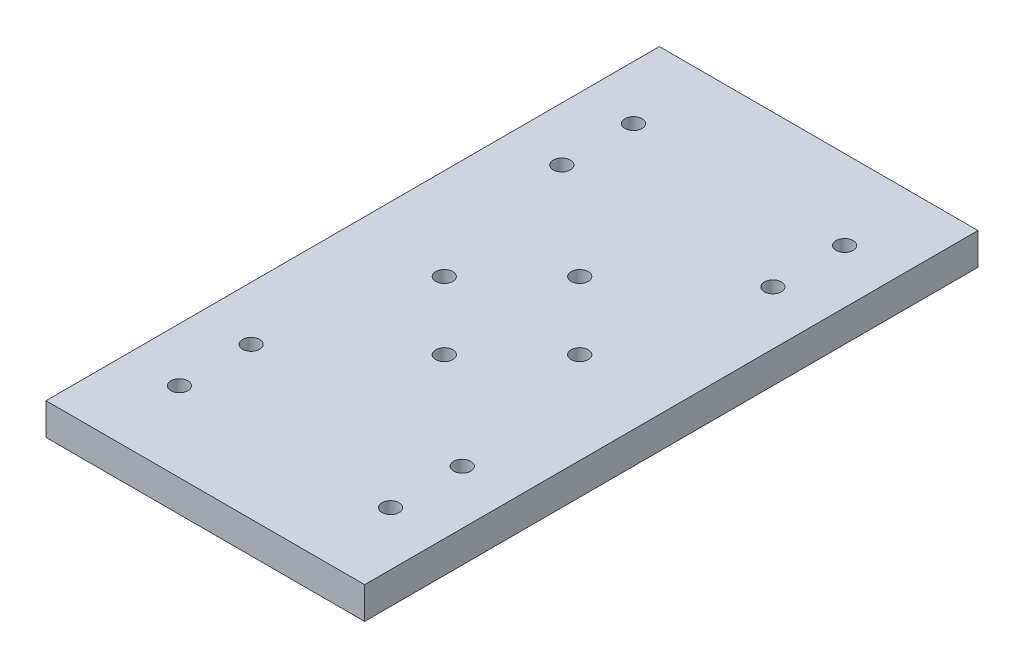
ISO-10303-21;
HEADER;
FILE_DESCRIPTION(('STEP AP214'),'2;1');
FILE_NAME('part.step','',(''),(''),'','','');
FILE_SCHEMA(('AUTOMOTIVE_DESIGN { 1 0 10303 214 1 1 1 1 }'));
ENDSEC;
DATA;
#1=APPLICATION_CONTEXT('core data for automotive mechanical design processes');
#2=APPLICATION_PROTOCOL_DEFINITION('international standard','automotive_design',2000,#1);
#3=PRODUCT_CONTEXT('',#1,'mechanical');
#4=PRODUCT('Part','Part','',(#3));
#5=PRODUCT_RELATED_PRODUCT_CATEGORY('part','',(#4));
#6=PRODUCT_DEFINITION_FORMATION('','',#4);
#7=PRODUCT_DEFINITION_CONTEXT('part definition',#1,'design');
#8=PRODUCT_DEFINITION('design','',#6,#7);
#9=PRODUCT_DEFINITION_SHAPE('','',#8);
#10=(LENGTH_UNIT() NAMED_UNIT(*) SI_UNIT(.MILLI.,.METRE.));
#11=(NAMED_UNIT(*) PLANE_ANGLE_UNIT() SI_UNIT($,.RADIAN.));
#12=(NAMED_UNIT(*) SI_UNIT($,.STERADIAN.) SOLID_ANGLE_UNIT());
#13=UNCERTAINTY_MEASURE_WITH_UNIT(LENGTH_MEASURE(1.E-05),#10,'distance_accuracy_value','');
#14=(GEOMETRIC_REPRESENTATION_CONTEXT(3) GLOBAL_UNCERTAINTY_ASSIGNED_CONTEXT((#13)) GLOBAL_UNIT_ASSIGNED_CONTEXT((#10,
#11,#12)) REPRESENTATION_CONTEXT('',''));
#15=CARTESIAN_POINT('',(0.,0.,0.));
#16=DIRECTION('',(0.,0.,1.));
#17=DIRECTION('',(1.,0.,0.));
#18=AXIS2_PLACEMENT_3D('',#15,#16,#17);
#19=CARTESIAN_POINT('',(-40.,8.,0.));
#20=DIRECTION('',(1.,0.,0.));
#21=DIRECTION('',(0.,0.,-1.));
#22=AXIS2_PLACEMENT_3D('',#19,#20,#21);
#23=PLANE('',#22);
#24=DIRECTION('',(0.,0.,1.));
#25=VECTOR('',#24,1.);
#26=CARTESIAN_POINT('',(-40.,0.,0.));
#27=LINE('',#26,#25);
#28=CARTESIAN_POINT('',(-40.,0.,-77.));
#29=VERTEX_POINT('',#28);
#30=CARTESIAN_POINT('',(-40.,0.,77.));
#31=VERTEX_POINT('',#30);
#32=EDGE_CURVE('E98',#29,#31,#27,.T.);
#33=ORIENTED_EDGE('',*,*,#32,.T.);
#34=DIRECTION('',(0.,1.,0.));
#35=VECTOR('',#34,1.);
#36=CARTESIAN_POINT('',(-40.,-2.,77.));
#37=LINE('',#36,#35);
#38=CARTESIAN_POINT('',(-40.,8.,77.));
#39=VERTEX_POINT('',#38);
#40=EDGE_CURVE('E50',#31,#39,#37,.T.);
#41=ORIENTED_EDGE('',*,*,#40,.T.);
#42=DIRECTION('',(0.,0.,1.));
#43=VECTOR('',#42,1.);
#44=CARTESIAN_POINT('',(-40.,8.,0.));
#45=LINE('',#44,#43);
#46=CARTESIAN_POINT('',(-40.,8.,-77.));
#47=VERTEX_POINT('',#46);
#48=EDGE_CURVE('E88',#47,#39,#45,.T.);
#49=ORIENTED_EDGE('',*,*,#48,.F.);
#50=DIRECTION('',(0.,1.,0.));
#51=VECTOR('',#50,1.);
#52=CARTESIAN_POINT('',(-40.,-2.,-77.));
#53=LINE('',#52,#51);
#54=EDGE_CURVE('E154',#29,#47,#53,.T.);
#55=ORIENTED_EDGE('',*,*,#54,.F.);
#56=EDGE_LOOP('',(#33,#41,#49,#55));
#57=FACE_BOUND('',#56,.T.);
#58=ADVANCED_FACE('F36',(#57),#23,.F.);
#59=CARTESIAN_POINT('',(40.,8.,0.));
#60=DIRECTION('',(-1.,0.,0.));
#61=DIRECTION('',(0.,0.,1.));
#62=AXIS2_PLACEMENT_3D('',#59,#60,#61);
#63=PLANE('',#62);
#64=DIRECTION('',(0.,0.,-1.));
#65=VECTOR('',#64,1.);
#66=CARTESIAN_POINT('',(40.,8.,0.));
#67=LINE('',#66,#65);
#68=CARTESIAN_POINT('',(40.,8.,77.));
#69=VERTEX_POINT('',#68);
#70=CARTESIAN_POINT('',(40.,8.,-77.));
#71=VERTEX_POINT('',#70);
#72=EDGE_CURVE('E85',#69,#71,#67,.T.);
#73=ORIENTED_EDGE('',*,*,#72,.F.);
#74=DIRECTION('',(0.,1.,0.));
#75=VECTOR('',#74,1.);
#76=CARTESIAN_POINT('',(40.,-2.,77.));
#77=LINE('',#76,#75);
#78=CARTESIAN_POINT('',(40.,0.,77.));
#79=VERTEX_POINT('',#78);
#80=EDGE_CURVE('E74',#79,#69,#77,.T.);
#81=ORIENTED_EDGE('',*,*,#80,.F.);
#82=DIRECTION('',(0.,0.,-1.));
#83=VECTOR('',#82,1.);
#84=CARTESIAN_POINT('',(40.,0.,0.));
#85=LINE('',#84,#83);
#86=CARTESIAN_POINT('',(40.,0.,-77.));
#87=VERTEX_POINT('',#86);
#88=EDGE_CURVE('E57',#79,#87,#85,.T.);
#89=ORIENTED_EDGE('',*,*,#88,.T.);
#90=DIRECTION('',(0.,1.,0.));
#91=VECTOR('',#90,1.);
#92=CARTESIAN_POINT('',(40.,-2.,-77.));
#93=LINE('',#92,#91);
#94=EDGE_CURVE('E92',#87,#71,#93,.T.);
#95=ORIENTED_EDGE('',*,*,#94,.T.);
#96=EDGE_LOOP('',(#73,#81,#89,#95));
#97=FACE_BOUND('',#96,.T.);
#98=ADVANCED_FACE('F91',(#97),#63,.F.);
#99=CARTESIAN_POINT('',(0.,8.,0.));
#100=DIRECTION('',(0.,1.,0.));
#101=DIRECTION('',(0.,0.,1.));
#102=AXIS2_PLACEMENT_3D('',#99,#100,#101);
#103=PLANE('',#102);
#104=CARTESIAN_POINT('',(-17.,8.,0.));
#105=DIRECTION('',(0.,1.,0.));
#106=DIRECTION('',(0.,0.,1.));
#107=AXIS2_PLACEMENT_3D('',#104,#105,#106);
#108=CIRCLE('',#107,2.14999999999999);
#109=CARTESIAN_POINT('',(-17.,8.,2.14999999999999));
#110=VERTEX_POINT('',#109);
#111=EDGE_CURVE('E180',#110,#110,#108,.T.);
#112=ORIENTED_EDGE('',*,*,#111,.F.);
#113=EDGE_LOOP('',(#112));
#114=FACE_BOUND('',#113,.T.);
#115=CARTESIAN_POINT('',(0.,8.,-17.));
#116=DIRECTION('',(0.,1.,0.));
#117=DIRECTION('',(0.,0.,1.));
#118=AXIS2_PLACEMENT_3D('',#115,#116,#117);
#119=CIRCLE('',#118,2.14999999999999);
#120=CARTESIAN_POINT('',(0.,8.,-14.85));
#121=VERTEX_POINT('',#120);
#122=EDGE_CURVE('E174',#121,#121,#119,.T.);
#123=ORIENTED_EDGE('',*,*,#122,.F.);
#124=EDGE_LOOP('',(#123));
#125=FACE_BOUND('',#124,.T.);
#126=CARTESIAN_POINT('',(17.,8.,0.));
#127=DIRECTION('',(0.,1.,0.));
#128=DIRECTION('',(0.,0.,1.));
#129=AXIS2_PLACEMENT_3D('',#126,#127,#128);
#130=CIRCLE('',#129,2.14999999999999);
#131=CARTESIAN_POINT('',(17.,8.,2.14999999999999));
#132=VERTEX_POINT('',#131);
#133=EDGE_CURVE('E168',#132,#132,#130,.T.);
#134=ORIENTED_EDGE('',*,*,#133,.F.);
#135=EDGE_LOOP('',(#134));
#136=FACE_BOUND('',#135,.T.);
#137=CARTESIAN_POINT('',(0.,8.,17.));
#138=DIRECTION('',(0.,1.,0.));
#139=DIRECTION('',(0.,0.,1.));
#140=AXIS2_PLACEMENT_3D('',#137,#138,#139);
#141=CIRCLE('',#140,2.14999999999999);
#142=CARTESIAN_POINT('',(0.,8.,19.15));
#143=VERTEX_POINT('',#142);
#144=EDGE_CURVE('E162',#143,#143,#141,.T.);
#145=ORIENTED_EDGE('',*,*,#144,.F.);
#146=EDGE_LOOP('',(#145));
#147=FACE_BOUND('',#146,.T.);
#148=DIRECTION('',(-1.,0.,0.));
#149=VECTOR('',#148,1.);
#150=CARTESIAN_POINT('',(40.,8.,77.));
#151=LINE('',#150,#149);
#152=EDGE_CURVE('E77',#69,#39,#151,.T.);
#153=ORIENTED_EDGE('',*,*,#152,.F.);
#154=ORIENTED_EDGE('',*,*,#72,.T.);
#155=DIRECTION('',(1.,0.,0.));
#156=VECTOR('',#155,1.);
#157=CARTESIAN_POINT('',(-40.,8.,-77.));
#158=LINE('',#157,#156);
#159=EDGE_CURVE('E156',#47,#71,#158,.T.);
#160=ORIENTED_EDGE('',*,*,#159,.F.);
#161=ORIENTED_EDGE('',*,*,#48,.T.);
#162=EDGE_LOOP('',(#153,#154,#160,#161));
#163=FACE_BOUND('',#162,.T.);
#164=CARTESIAN_POINT('',(-26.5,8.,-57.));
#165=DIRECTION('',(0.,1.,0.));
#166=DIRECTION('',(0.,0.,1.));
#167=AXIS2_PLACEMENT_3D('',#164,#165,#166);
#168=CIRCLE('',#167,2.15);
#169=CARTESIAN_POINT('',(-26.5,8.,-54.85));
#170=VERTEX_POINT('',#169);
#171=EDGE_CURVE('E151',#170,#170,#168,.T.);
#172=ORIENTED_EDGE('',*,*,#171,.F.);
#173=EDGE_LOOP('',(#172));
#174=FACE_BOUND('',#173,.T.);
#175=CARTESIAN_POINT('',(26.5,8.,-57.));
#176=DIRECTION('',(0.,1.,0.));
#177=DIRECTION('',(0.,0.,1.));
#178=AXIS2_PLACEMENT_3D('',#175,#176,#177);
#179=CIRCLE('',#178,2.15);
#180=CARTESIAN_POINT('',(26.5,8.,-54.85));
#181=VERTEX_POINT('',#180);
#182=EDGE_CURVE('E145',#181,#181,#179,.T.);
#183=ORIENTED_EDGE('',*,*,#182,.F.);
#184=EDGE_LOOP('',(#183));
#185=FACE_BOUND('',#184,.T.);
#186=CARTESIAN_POINT('',(-26.5,8.,-39.));
#187=DIRECTION('',(0.,1.,0.));
#188=DIRECTION('',(0.,0.,1.));
#189=AXIS2_PLACEMENT_3D('',#186,#187,#188);
#190=CIRCLE('',#189,2.15);
#191=CARTESIAN_POINT('',(-26.5,8.,-36.85));
#192=VERTEX_POINT('',#191);
#193=EDGE_CURVE('E139',#192,#192,#190,.T.);
#194=ORIENTED_EDGE('',*,*,#193,.F.);
#195=EDGE_LOOP('',(#194));
#196=FACE_BOUND('',#195,.T.);
#197=CARTESIAN_POINT('',(26.5,8.,-39.));
#198=DIRECTION('',(0.,1.,0.));
#199=DIRECTION('',(0.,0.,1.));
#200=AXIS2_PLACEMENT_3D('',#197,#198,#199);
#201=CIRCLE('',#200,2.15);
#202=CARTESIAN_POINT('',(26.5,8.,-36.85));
#203=VERTEX_POINT('',#202);
#204=EDGE_CURVE('E133',#203,#203,#201,.T.);
#205=ORIENTED_EDGE('',*,*,#204,.F.);
#206=EDGE_LOOP('',(#205));
#207=FACE_BOUND('',#206,.T.);
#208=CARTESIAN_POINT('',(26.5,8.,39.));
#209=DIRECTION('',(0.,1.,0.));
#210=DIRECTION('',(0.,0.,1.));
#211=AXIS2_PLACEMENT_3D('',#208,#209,#210);
#212=CIRCLE('',#211,2.15);
#213=CARTESIAN_POINT('',(26.5,8.,41.15));
#214=VERTEX_POINT('',#213);
#215=EDGE_CURVE('E127',#214,#214,#212,.T.);
#216=ORIENTED_EDGE('',*,*,#215,.F.);
#217=EDGE_LOOP('',(#216));
#218=FACE_BOUND('',#217,.T.);
#219=CARTESIAN_POINT('',(-26.5,8.,39.));
#220=DIRECTION('',(0.,1.,0.));
#221=DIRECTION('',(0.,0.,1.));
#222=AXIS2_PLACEMENT_3D('',#219,#220,#221);
#223=CIRCLE('',#222,2.15);
#224=CARTESIAN_POINT('',(-26.5,8.,41.15));
#225=VERTEX_POINT('',#224);
#226=EDGE_CURVE('E121',#225,#225,#223,.T.);
#227=ORIENTED_EDGE('',*,*,#226,.F.);
#228=EDGE_LOOP('',(#227));
#229=FACE_BOUND('',#228,.T.);
#230=CARTESIAN_POINT('',(26.5,8.,57.));
#231=DIRECTION('',(0.,1.,0.));
#232=DIRECTION('',(0.,0.,1.));
#233=AXIS2_PLACEMENT_3D('',#230,#231,#232);
#234=CIRCLE('',#233,2.15);
#235=CARTESIAN_POINT('',(26.5,8.,59.15));
#236=VERTEX_POINT('',#235);
#237=EDGE_CURVE('E115',#236,#236,#234,.T.);
#238=ORIENTED_EDGE('',*,*,#237,.F.);
#239=EDGE_LOOP('',(#238));
#240=FACE_BOUND('',#239,.T.);
#241=CARTESIAN_POINT('',(-26.5,8.,57.));
#242=DIRECTION('',(0.,1.,0.));
#243=DIRECTION('',(0.,0.,1.));
#244=AXIS2_PLACEMENT_3D('',#241,#242,#243);
#245=CIRCLE('',#244,2.15);
#246=CARTESIAN_POINT('',(-26.5,8.,59.15));
#247=VERTEX_POINT('',#246);
#248=EDGE_CURVE('E106',#247,#247,#245,.T.);
#249=ORIENTED_EDGE('',*,*,#248,.F.);
#250=EDGE_LOOP('',(#249));
#251=FACE_BOUND('',#250,.T.);
#252=ADVANCED_FACE('F82',(#114,#125,#136,#147,#163,#174,#185,#196,#207,#218,#229,#240,#251),
#103,.T.);
#253=CARTESIAN_POINT('',(0.,0.,0.));
#254=DIRECTION('',(0.,1.,0.));
#255=DIRECTION('',(0.,0.,1.));
#256=AXIS2_PLACEMENT_3D('',#253,#254,#255);
#257=PLANE('',#256);
#258=CARTESIAN_POINT('',(-17.,0.,0.));
#259=DIRECTION('',(0.,1.,0.));
#260=DIRECTION('',(0.,0.,1.));
#261=AXIS2_PLACEMENT_3D('',#258,#259,#260);
#262=CIRCLE('',#261,2.15);
#263=CARTESIAN_POINT('',(-17.,0.,2.15));
#264=VERTEX_POINT('',#263);
#265=EDGE_CURVE('E177',#264,#264,#262,.T.);
#266=ORIENTED_EDGE('',*,*,#265,.T.);
#267=EDGE_LOOP('',(#266));
#268=FACE_BOUND('',#267,.T.);
#269=CARTESIAN_POINT('',(0.,0.,-17.));
#270=DIRECTION('',(0.,1.,0.));
#271=DIRECTION('',(0.,0.,1.));
#272=AXIS2_PLACEMENT_3D('',#269,#270,#271);
#273=CIRCLE('',#272,2.15);
#274=CARTESIAN_POINT('',(0.,0.,-14.85));
#275=VERTEX_POINT('',#274);
#276=EDGE_CURVE('E171',#275,#275,#273,.T.);
#277=ORIENTED_EDGE('',*,*,#276,.T.);
#278=EDGE_LOOP('',(#277));
#279=FACE_BOUND('',#278,.T.);
#280=CARTESIAN_POINT('',(17.,0.,0.));
#281=DIRECTION('',(0.,1.,0.));
#282=DIRECTION('',(0.,0.,1.));
#283=AXIS2_PLACEMENT_3D('',#280,#281,#282);
#284=CIRCLE('',#283,2.15);
#285=CARTESIAN_POINT('',(17.,0.,2.15));
#286=VERTEX_POINT('',#285);
#287=EDGE_CURVE('E165',#286,#286,#284,.T.);
#288=ORIENTED_EDGE('',*,*,#287,.T.);
#289=EDGE_LOOP('',(#288));
#290=FACE_BOUND('',#289,.T.);
#291=CARTESIAN_POINT('',(0.,0.,17.));
#292=DIRECTION('',(0.,1.,0.));
#293=DIRECTION('',(0.,0.,1.));
#294=AXIS2_PLACEMENT_3D('',#291,#292,#293);
#295=CIRCLE('',#294,2.15);
#296=CARTESIAN_POINT('',(0.,0.,19.15));
#297=VERTEX_POINT('',#296);
#298=EDGE_CURVE('E89',#297,#297,#295,.T.);
#299=ORIENTED_EDGE('',*,*,#298,.T.);
#300=EDGE_LOOP('',(#299));
#301=FACE_BOUND('',#300,.T.);
#302=CARTESIAN_POINT('',(-26.5,0.,-57.));
#303=DIRECTION('',(0.,1.,0.));
#304=DIRECTION('',(0.,0.,1.));
#305=AXIS2_PLACEMENT_3D('',#302,#303,#304);
#306=CIRCLE('',#305,2.15);
#307=CARTESIAN_POINT('',(-26.5,0.,-54.85));
#308=VERTEX_POINT('',#307);
#309=EDGE_CURVE('E148',#308,#308,#306,.T.);
#310=ORIENTED_EDGE('',*,*,#309,.T.);
#311=EDGE_LOOP('',(#310));
#312=FACE_BOUND('',#311,.T.);
#313=CARTESIAN_POINT('',(26.5,0.,-57.));
#314=DIRECTION('',(0.,1.,0.));
#315=DIRECTION('',(0.,0.,1.));
#316=AXIS2_PLACEMENT_3D('',#313,#314,#315);
#317=CIRCLE('',#316,2.15);
#318=CARTESIAN_POINT('',(26.5,0.,-54.85));
#319=VERTEX_POINT('',#318);
#320=EDGE_CURVE('E142',#319,#319,#317,.T.);
#321=ORIENTED_EDGE('',*,*,#320,.T.);
#322=EDGE_LOOP('',(#321));
#323=FACE_BOUND('',#322,.T.);
#324=CARTESIAN_POINT('',(-26.5,0.,-39.));
#325=DIRECTION('',(0.,1.,0.));
#326=DIRECTION('',(0.,0.,1.));
#327=AXIS2_PLACEMENT_3D('',#324,#325,#326);
#328=CIRCLE('',#327,2.15);
#329=CARTESIAN_POINT('',(-26.5,0.,-36.85));
#330=VERTEX_POINT('',#329);
#331=EDGE_CURVE('E136',#330,#330,#328,.T.);
#332=ORIENTED_EDGE('',*,*,#331,.T.);
#333=EDGE_LOOP('',(#332));
#334=FACE_BOUND('',#333,.T.);
#335=CARTESIAN_POINT('',(26.5,0.,-39.));
#336=DIRECTION('',(0.,1.,0.));
#337=DIRECTION('',(0.,0.,1.));
#338=AXIS2_PLACEMENT_3D('',#335,#336,#337);
#339=CIRCLE('',#338,2.15);
#340=CARTESIAN_POINT('',(26.5,0.,-36.85));
#341=VERTEX_POINT('',#340);
#342=EDGE_CURVE('E130',#341,#341,#339,.T.);
#343=ORIENTED_EDGE('',*,*,#342,.T.);
#344=EDGE_LOOP('',(#343));
#345=FACE_BOUND('',#344,.T.);
#346=CARTESIAN_POINT('',(26.5,0.,39.));
#347=DIRECTION('',(0.,1.,0.));
#348=DIRECTION('',(0.,0.,1.));
#349=AXIS2_PLACEMENT_3D('',#346,#347,#348);
#350=CIRCLE('',#349,2.15);
#351=CARTESIAN_POINT('',(26.5,0.,41.15));
#352=VERTEX_POINT('',#351);
#353=EDGE_CURVE('E124',#352,#352,#350,.T.);
#354=ORIENTED_EDGE('',*,*,#353,.T.);
#355=EDGE_LOOP('',(#354));
#356=FACE_BOUND('',#355,.T.);
#357=CARTESIAN_POINT('',(-26.5,0.,39.));
#358=DIRECTION('',(0.,1.,0.));
#359=DIRECTION('',(0.,0.,1.));
#360=AXIS2_PLACEMENT_3D('',#357,#358,#359);
#361=CIRCLE('',#360,2.15);
#362=CARTESIAN_POINT('',(-26.5,0.,41.15));
#363=VERTEX_POINT('',#362);
#364=EDGE_CURVE('E118',#363,#363,#361,.T.);
#365=ORIENTED_EDGE('',*,*,#364,.T.);
#366=EDGE_LOOP('',(#365));
#367=FACE_BOUND('',#366,.T.);
#368=CARTESIAN_POINT('',(26.5,0.,57.));
#369=DIRECTION('',(0.,1.,0.));
#370=DIRECTION('',(0.,0.,1.));
#371=AXIS2_PLACEMENT_3D('',#368,#369,#370);
#372=CIRCLE('',#371,2.15);
#373=CARTESIAN_POINT('',(26.5,0.,59.15));
#374=VERTEX_POINT('',#373);
#375=EDGE_CURVE('E110',#374,#374,#372,.T.);
#376=ORIENTED_EDGE('',*,*,#375,.T.);
#377=EDGE_LOOP('',(#376));
#378=FACE_BOUND('',#377,.T.);
#379=CARTESIAN_POINT('',(-26.5,0.,57.));
#380=DIRECTION('',(0.,1.,0.));
#381=DIRECTION('',(0.,0.,1.));
#382=AXIS2_PLACEMENT_3D('',#379,#380,#381);
#383=CIRCLE('',#382,2.15);
#384=CARTESIAN_POINT('',(-26.5,0.,59.15));
#385=VERTEX_POINT('',#384);
#386=EDGE_CURVE('E101',#385,#385,#383,.T.);
#387=ORIENTED_EDGE('',*,*,#386,.T.);
#388=EDGE_LOOP('',(#387));
#389=FACE_BOUND('',#388,.T.);
#390=ORIENTED_EDGE('',*,*,#88,.F.);
#391=DIRECTION('',(-1.,0.,0.));
#392=VECTOR('',#391,1.);
#393=CARTESIAN_POINT('',(0.,0.,77.));
#394=LINE('',#393,#392);
#395=EDGE_CURVE('E11',#79,#31,#394,.T.);
#396=ORIENTED_EDGE('',*,*,#395,.T.);
#397=ORIENTED_EDGE('',*,*,#32,.F.);
#398=DIRECTION('',(1.,0.,0.));
#399=VECTOR('',#398,1.);
#400=CARTESIAN_POINT('',(0.,0.,-77.));
#401=LINE('',#400,#399);
#402=EDGE_CURVE('E43',#29,#87,#401,.T.);
#403=ORIENTED_EDGE('',*,*,#402,.T.);
#404=EDGE_LOOP('',(#390,#396,#397,#403));
#405=FACE_BOUND('',#404,.T.);
#406=ADVANCED_FACE('F188',(#268,#279,#290,#301,#312,#323,#334,#345,#356,#367,#378,#389,#405),
#257,.F.);
#407=CARTESIAN_POINT('',(-26.5,8.,57.));
#408=DIRECTION('',(0.,1.,0.));
#409=DIRECTION('',(0.,0.,1.));
#410=AXIS2_PLACEMENT_3D('',#407,#408,#409);
#411=CYLINDRICAL_SURFACE('',#410,2.15);
#412=ORIENTED_EDGE('',*,*,#386,.F.);
#413=EDGE_LOOP('',(#412));
#414=FACE_BOUND('',#413,.T.);
#415=ORIENTED_EDGE('',*,*,#248,.T.);
#416=EDGE_LOOP('',(#415));
#417=FACE_BOUND('',#416,.T.);
#418=ADVANCED_FACE('F219',(#414,#417),#411,.F.);
#419=CARTESIAN_POINT('',(26.5,8.,57.));
#420=DIRECTION('',(0.,1.,0.));
#421=DIRECTION('',(0.,0.,1.));
#422=AXIS2_PLACEMENT_3D('',#419,#420,#421);
#423=CYLINDRICAL_SURFACE('',#422,2.15);
#424=ORIENTED_EDGE('',*,*,#375,.F.);
#425=EDGE_LOOP('',(#424));
#426=FACE_BOUND('',#425,.T.);
#427=ORIENTED_EDGE('',*,*,#237,.T.);
#428=EDGE_LOOP('',(#427));
#429=FACE_BOUND('',#428,.T.);
#430=ADVANCED_FACE('F224',(#426,#429),#423,.F.);
#431=CARTESIAN_POINT('',(-26.5,8.,39.));
#432=DIRECTION('',(0.,1.,0.));
#433=DIRECTION('',(0.,0.,1.));
#434=AXIS2_PLACEMENT_3D('',#431,#432,#433);
#435=CYLINDRICAL_SURFACE('',#434,2.15);
#436=ORIENTED_EDGE('',*,*,#364,.F.);
#437=EDGE_LOOP('',(#436));
#438=FACE_BOUND('',#437,.T.);
#439=ORIENTED_EDGE('',*,*,#226,.T.);
#440=EDGE_LOOP('',(#439));
#441=FACE_BOUND('',#440,.T.);
#442=ADVANCED_FACE('F228',(#438,#441),#435,.F.);
#443=CARTESIAN_POINT('',(26.5,8.,39.));
#444=DIRECTION('',(0.,1.,0.));
#445=DIRECTION('',(0.,0.,1.));
#446=AXIS2_PLACEMENT_3D('',#443,#444,#445);
#447=CYLINDRICAL_SURFACE('',#446,2.15);
#448=ORIENTED_EDGE('',*,*,#353,.F.);
#449=EDGE_LOOP('',(#448));
#450=FACE_BOUND('',#449,.T.);
#451=ORIENTED_EDGE('',*,*,#215,.T.);
#452=EDGE_LOOP('',(#451));
#453=FACE_BOUND('',#452,.T.);
#454=ADVANCED_FACE('F232',(#450,#453),#447,.F.);
#455=CARTESIAN_POINT('',(26.5,8.,-39.));
#456=DIRECTION('',(0.,1.,0.));
#457=DIRECTION('',(0.,0.,1.));
#458=AXIS2_PLACEMENT_3D('',#455,#456,#457);
#459=CYLINDRICAL_SURFACE('',#458,2.15);
#460=ORIENTED_EDGE('',*,*,#342,.F.);
#461=EDGE_LOOP('',(#460));
#462=FACE_BOUND('',#461,.T.);
#463=ORIENTED_EDGE('',*,*,#204,.T.);
#464=EDGE_LOOP('',(#463));
#465=FACE_BOUND('',#464,.T.);
#466=ADVANCED_FACE('F236',(#462,#465),#459,.F.);
#467=CARTESIAN_POINT('',(-26.5,8.,-39.));
#468=DIRECTION('',(0.,1.,0.));
#469=DIRECTION('',(0.,0.,1.));
#470=AXIS2_PLACEMENT_3D('',#467,#468,#469);
#471=CYLINDRICAL_SURFACE('',#470,2.15);
#472=ORIENTED_EDGE('',*,*,#331,.F.);
#473=EDGE_LOOP('',(#472));
#474=FACE_BOUND('',#473,.T.);
#475=ORIENTED_EDGE('',*,*,#193,.T.);
#476=EDGE_LOOP('',(#475));
#477=FACE_BOUND('',#476,.T.);
#478=ADVANCED_FACE('F240',(#474,#477),#471,.F.);
#479=CARTESIAN_POINT('',(26.5,8.,-57.));
#480=DIRECTION('',(0.,1.,0.));
#481=DIRECTION('',(0.,0.,1.));
#482=AXIS2_PLACEMENT_3D('',#479,#480,#481);
#483=CYLINDRICAL_SURFACE('',#482,2.15);
#484=ORIENTED_EDGE('',*,*,#320,.F.);
#485=EDGE_LOOP('',(#484));
#486=FACE_BOUND('',#485,.T.);
#487=ORIENTED_EDGE('',*,*,#182,.T.);
#488=EDGE_LOOP('',(#487));
#489=FACE_BOUND('',#488,.T.);
#490=ADVANCED_FACE('F244',(#486,#489),#483,.F.);
#491=CARTESIAN_POINT('',(-26.5,8.,-57.));
#492=DIRECTION('',(0.,1.,0.));
#493=DIRECTION('',(0.,0.,1.));
#494=AXIS2_PLACEMENT_3D('',#491,#492,#493);
#495=CYLINDRICAL_SURFACE('',#494,2.15);
#496=ORIENTED_EDGE('',*,*,#309,.F.);
#497=EDGE_LOOP('',(#496));
#498=FACE_BOUND('',#497,.T.);
#499=ORIENTED_EDGE('',*,*,#171,.T.);
#500=EDGE_LOOP('',(#499));
#501=FACE_BOUND('',#500,.T.);
#502=ADVANCED_FACE('F248',(#498,#501),#495,.F.);
#503=CARTESIAN_POINT('',(-40.,-2.,-77.));
#504=DIRECTION('',(0.,0.,1.));
#505=DIRECTION('',(1.,0.,0.));
#506=AXIS2_PLACEMENT_3D('',#503,#504,#505);
#507=PLANE('',#506);
#508=ORIENTED_EDGE('',*,*,#54,.T.);
#509=ORIENTED_EDGE('',*,*,#159,.T.);
#510=ORIENTED_EDGE('',*,*,#94,.F.);
#511=ORIENTED_EDGE('',*,*,#402,.F.);
#512=EDGE_LOOP('',(#508,#509,#510,#511));
#513=FACE_BOUND('',#512,.T.);
#514=ADVANCED_FACE('F208',(#513),#507,.F.);
#515=CARTESIAN_POINT('',(40.,-2.,77.));
#516=DIRECTION('',(0.,0.,-1.));
#517=DIRECTION('',(-1.,0.,0.));
#518=AXIS2_PLACEMENT_3D('',#515,#516,#517);
#519=PLANE('',#518);
#520=ORIENTED_EDGE('',*,*,#80,.T.);
#521=ORIENTED_EDGE('',*,*,#152,.T.);
#522=ORIENTED_EDGE('',*,*,#40,.F.);
#523=ORIENTED_EDGE('',*,*,#395,.F.);
#524=EDGE_LOOP('',(#520,#521,#522,#523));
#525=FACE_BOUND('',#524,.T.);
#526=ADVANCED_FACE('F76',(#525),#519,.F.);
#527=CARTESIAN_POINT('',(0.,8.,17.));
#528=DIRECTION('',(0.,1.,0.));
#529=DIRECTION('',(0.,0.,1.));
#530=AXIS2_PLACEMENT_3D('',#527,#528,#529);
#531=CYLINDRICAL_SURFACE('',#530,2.14999999999999);
#532=ORIENTED_EDGE('',*,*,#298,.F.);
#533=EDGE_LOOP('',(#532));
#534=FACE_BOUND('',#533,.T.);
#535=ORIENTED_EDGE('',*,*,#144,.T.);
#536=EDGE_LOOP('',(#535));
#537=FACE_BOUND('',#536,.T.);
#538=ADVANCED_FACE('F196',(#534,#537),#531,.F.);
#539=CARTESIAN_POINT('',(17.,8.,0.));
#540=DIRECTION('',(0.,1.,0.));
#541=DIRECTION('',(0.,0.,1.));
#542=AXIS2_PLACEMENT_3D('',#539,#540,#541);
#543=CYLINDRICAL_SURFACE('',#542,2.14999999999999);
#544=ORIENTED_EDGE('',*,*,#287,.F.);
#545=EDGE_LOOP('',(#544));
#546=FACE_BOUND('',#545,.T.);
#547=ORIENTED_EDGE('',*,*,#133,.T.);
#548=EDGE_LOOP('',(#547));
#549=FACE_BOUND('',#548,.T.);
#550=ADVANCED_FACE('F198',(#546,#549),#543,.F.);
#551=CARTESIAN_POINT('',(0.,8.,-17.));
#552=DIRECTION('',(0.,1.,0.));
#553=DIRECTION('',(0.,0.,1.));
#554=AXIS2_PLACEMENT_3D('',#551,#552,#553);
#555=CYLINDRICAL_SURFACE('',#554,2.14999999999999);
#556=ORIENTED_EDGE('',*,*,#276,.F.);
#557=EDGE_LOOP('',(#556));
#558=FACE_BOUND('',#557,.T.);
#559=ORIENTED_EDGE('',*,*,#122,.T.);
#560=EDGE_LOOP('',(#559));
#561=FACE_BOUND('',#560,.T.);
#562=ADVANCED_FACE('F205',(#558,#561),#555,.F.);
#563=CARTESIAN_POINT('',(-17.,8.,0.));
#564=DIRECTION('',(0.,1.,0.));
#565=DIRECTION('',(0.,0.,1.));
#566=AXIS2_PLACEMENT_3D('',#563,#564,#565);
#567=CYLINDRICAL_SURFACE('',#566,2.14999999999999);
#568=ORIENTED_EDGE('',*,*,#265,.F.);
#569=EDGE_LOOP('',(#568));
#570=FACE_BOUND('',#569,.T.);
#571=ORIENTED_EDGE('',*,*,#111,.T.);
#572=EDGE_LOOP('',(#571));
#573=FACE_BOUND('',#572,.T.);
#574=ADVANCED_FACE('F184',(#570,#573),#567,.F.);
#575=CLOSED_SHELL('',(#58,#98,#252,#406,#418,#430,#442,#454,#466,#478,#490,#502,#514,#526,#538,
#550,#562,#574));
#576=MANIFOLD_SOLID_BREP('B2',#575);
#577=ADVANCED_BREP_SHAPE_REPRESENTATION('',(#18,#576),#14);
#578=SHAPE_DEFINITION_REPRESENTATION(#9,#577);
ENDSEC;
END-ISO-10303-21;
